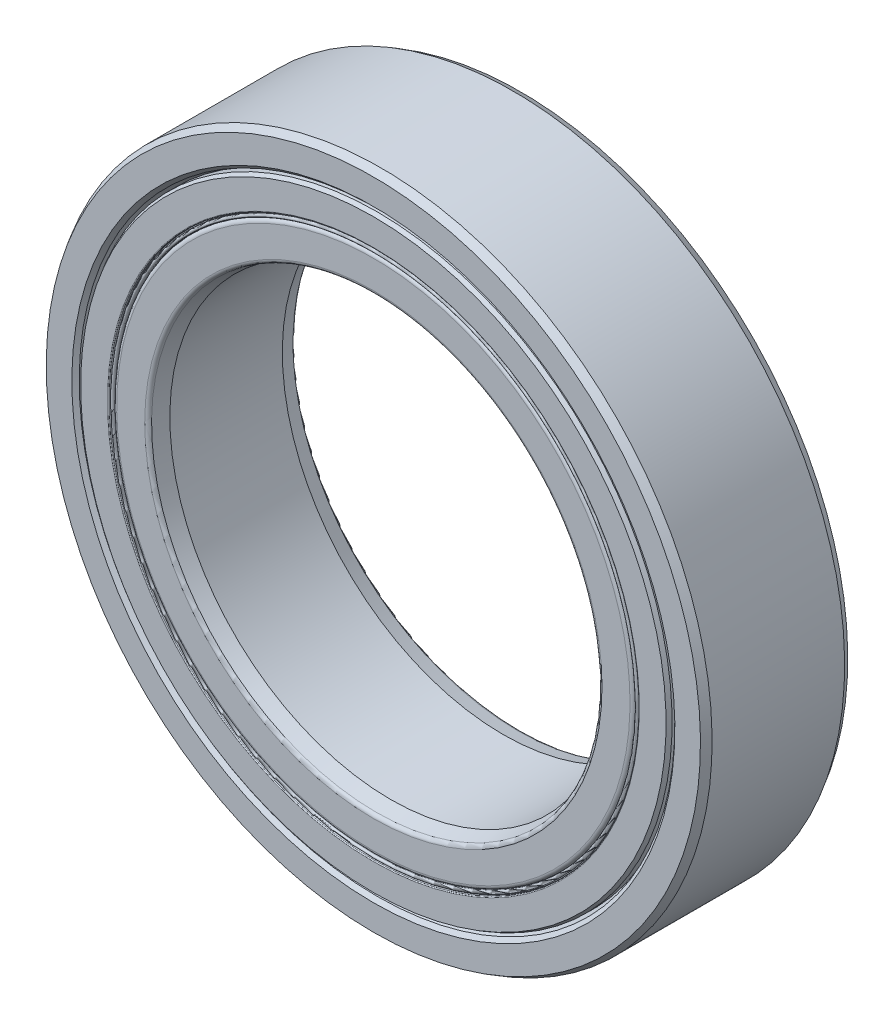
ISO-10303-21;
HEADER;
FILE_DESCRIPTION(('STEP AP214'),'2;1');
FILE_NAME('part.step','',(''),(''),'','','');
FILE_SCHEMA(('AUTOMOTIVE_DESIGN { 1 0 10303 214 1 1 1 1 }'));
ENDSEC;
DATA;
#1=APPLICATION_CONTEXT('core data for automotive mechanical design processes');
#2=APPLICATION_PROTOCOL_DEFINITION('international standard','automotive_design',2000,#1);
#3=PRODUCT_CONTEXT('',#1,'mechanical');
#4=PRODUCT('Part','Part','',(#3));
#5=PRODUCT_RELATED_PRODUCT_CATEGORY('part','',(#4));
#6=PRODUCT_DEFINITION_FORMATION('','',#4);
#7=PRODUCT_DEFINITION_CONTEXT('part definition',#1,'design');
#8=PRODUCT_DEFINITION('design','',#6,#7);
#9=PRODUCT_DEFINITION_SHAPE('','',#8);
#10=(LENGTH_UNIT() NAMED_UNIT(*) SI_UNIT(.MILLI.,.METRE.));
#11=(NAMED_UNIT(*) PLANE_ANGLE_UNIT() SI_UNIT($,.RADIAN.));
#12=(NAMED_UNIT(*) SI_UNIT($,.STERADIAN.) SOLID_ANGLE_UNIT());
#13=UNCERTAINTY_MEASURE_WITH_UNIT(LENGTH_MEASURE(1.E-05),#10,'distance_accuracy_value','');
#14=(GEOMETRIC_REPRESENTATION_CONTEXT(3) GLOBAL_UNCERTAINTY_ASSIGNED_CONTEXT((#13)) GLOBAL_UNIT_ASSIGNED_CONTEXT((#10,
#11,#12)) REPRESENTATION_CONTEXT('',''));
#15=CARTESIAN_POINT('',(0.,0.,0.));
#16=DIRECTION('',(0.,0.,1.));
#17=DIRECTION('',(1.,0.,0.));
#18=AXIS2_PLACEMENT_3D('',#15,#16,#17);
#19=CARTESIAN_POINT('',(0.,7.07999999999999,1.125));
#20=DIRECTION('',(0.,0.,1.));
#21=DIRECTION('',(0.,-1.,0.));
#22=AXIS2_PLACEMENT_3D('',#19,#20,#21);
#23=PLANE('',#22);
#24=CARTESIAN_POINT('',(0.,0.,1.125));
#25=DIRECTION('',(0.,0.,1.));
#26=DIRECTION('',(0.,-1.,0.));
#27=AXIS2_PLACEMENT_3D('',#24,#25,#26);
#28=CIRCLE('',#27,7.19999999999999);
#29=CARTESIAN_POINT('',(0.,-7.19999999999999,1.125));
#30=VERTEX_POINT('',#29);
#31=EDGE_CURVE('E11',#30,#30,#28,.T.);
#32=ORIENTED_EDGE('',*,*,#31,.F.);
#33=EDGE_LOOP('',(#32));
#34=FACE_BOUND('',#33,.T.);
#35=CARTESIAN_POINT('',(0.,0.,1.125));
#36=DIRECTION('',(0.,0.,1.));
#37=DIRECTION('',(0.,-1.,0.));
#38=AXIS2_PLACEMENT_3D('',#35,#36,#37);
#39=CIRCLE('',#38,7.07999999999999);
#40=CARTESIAN_POINT('',(0.,-7.07999999999999,1.125));
#41=VERTEX_POINT('',#40);
#42=EDGE_CURVE('E73',#41,#41,#39,.T.);
#43=ORIENTED_EDGE('',*,*,#42,.T.);
#44=EDGE_LOOP('',(#43));
#45=FACE_BOUND('',#44,.T.);
#46=ADVANCED_FACE('F48',(#34,#45),#23,.F.);
#47=CARTESIAN_POINT('',(0.,0.,2.));
#48=DIRECTION('',(0.,0.,1.));
#49=DIRECTION('',(0.,-1.,0.));
#50=AXIS2_PLACEMENT_3D('',#47,#48,#49);
#51=CYLINDRICAL_SURFACE('',#50,7.19999999999999);
#52=CARTESIAN_POINT('',(0.,0.,1.90262465990578));
#53=DIRECTION('',(0.,0.,1.));
#54=DIRECTION('',(0.,-1.,0.));
#55=AXIS2_PLACEMENT_3D('',#52,#53,#54);
#56=CIRCLE('',#55,7.19999999999999);
#57=CARTESIAN_POINT('',(0.,-7.19999999999999,1.90262465990578));
#58=VERTEX_POINT('',#57);
#59=EDGE_CURVE('E54',#58,#58,#56,.T.);
#60=ORIENTED_EDGE('',*,*,#59,.F.);
#61=EDGE_LOOP('',(#60));
#62=FACE_BOUND('',#61,.T.);
#63=ORIENTED_EDGE('',*,*,#31,.T.);
#64=EDGE_LOOP('',(#63));
#65=FACE_BOUND('',#64,.T.);
#66=ADVANCED_FACE('F104',(#62,#65),#51,.T.);
#67=CARTESIAN_POINT('',(0.,0.,1.90262465990578));
#68=DIRECTION('',(0.,0.,-1.));
#69=DIRECTION('',(0.,1.,0.));
#70=AXIS2_PLACEMENT_3D('',#67,#68,#69);
#71=CONICAL_SURFACE('',#70,7.19999999999999,0.174532925199437);
#72=CARTESIAN_POINT('',(0.,0.,1.93216889249615));
#73=DIRECTION('',(0.,0.,1.));
#74=DIRECTION('',(0.,-1.,0.));
#75=AXIS2_PLACEMENT_3D('',#72,#73,#74);
#76=CIRCLE('',#75,7.19479055466999);
#77=CARTESIAN_POINT('',(0.,-7.19479055466999,1.93216889249615));
#78=VERTEX_POINT('',#77);
#79=EDGE_CURVE('E58',#78,#78,#76,.T.);
#80=ORIENTED_EDGE('',*,*,#79,.F.);
#81=EDGE_LOOP('',(#80));
#82=FACE_BOUND('',#81,.T.);
#83=ORIENTED_EDGE('',*,*,#59,.T.);
#84=EDGE_LOOP('',(#83));
#85=FACE_BOUND('',#84,.T.);
#86=ADVANCED_FACE('F99',(#82,#85),#71,.T.);
#87=CARTESIAN_POINT('',(0.,0.,1.93));
#88=DIRECTION('',(0.,0.,1.));
#89=DIRECTION('',(0.,-1.,0.));
#90=AXIS2_PLACEMENT_3D('',#87,#88,#89);
#91=TOROIDAL_SURFACE('',#90,7.1824901540879,0.0124901540879058);
#92=CARTESIAN_POINT('',(0.,0.,1.93));
#93=DIRECTION('',(0.,0.,1.));
#94=DIRECTION('',(0.,-1.,0.));
#95=AXIS2_PLACEMENT_3D('',#92,#93,#94);
#96=CIRCLE('',#95,7.16999999999999);
#97=CARTESIAN_POINT('',(0.,-7.16999999999999,1.93));
#98=VERTEX_POINT('',#97);
#99=EDGE_CURVE('E62',#98,#98,#96,.T.);
#100=ORIENTED_EDGE('',*,*,#99,.F.);
#101=EDGE_LOOP('',(#100));
#102=FACE_BOUND('',#101,.T.);
#103=ORIENTED_EDGE('',*,*,#79,.T.);
#104=EDGE_LOOP('',(#103));
#105=FACE_BOUND('',#104,.T.);
#106=ADVANCED_FACE('F93',(#102,#105),#91,.T.);
#107=CARTESIAN_POINT('',(0.,0.,2.));
#108=DIRECTION('',(0.,0.,1.));
#109=DIRECTION('',(0.,-1.,0.));
#110=AXIS2_PLACEMENT_3D('',#107,#108,#109);
#111=CYLINDRICAL_SURFACE('',#110,7.16999999999999);
#112=CARTESIAN_POINT('',(0.,0.,1.955));
#113=DIRECTION('',(0.,0.,1.));
#114=DIRECTION('',(0.,-1.,0.));
#115=AXIS2_PLACEMENT_3D('',#112,#113,#114);
#116=CIRCLE('',#115,7.16999999999999);
#117=CARTESIAN_POINT('',(0.,-7.16999999999999,1.955));
#118=VERTEX_POINT('',#117);
#119=EDGE_CURVE('E67',#118,#118,#116,.T.);
#120=ORIENTED_EDGE('',*,*,#119,.F.);
#121=EDGE_LOOP('',(#120));
#122=FACE_BOUND('',#121,.T.);
#123=ORIENTED_EDGE('',*,*,#99,.T.);
#124=EDGE_LOOP('',(#123));
#125=FACE_BOUND('',#124,.T.);
#126=ADVANCED_FACE('F87',(#122,#125),#111,.T.);
#127=CARTESIAN_POINT('',(0.,0.,1.955));
#128=DIRECTION('',(0.,0.,1.));
#129=DIRECTION('',(0.,-1.,0.));
#130=AXIS2_PLACEMENT_3D('',#127,#128,#129);
#131=TOROIDAL_SURFACE('',#130,7.12499999999999,0.0449999999999999);
#132=CARTESIAN_POINT('',(0.,0.,1.955));
#133=DIRECTION('',(0.,0.,1.));
#134=DIRECTION('',(0.,-1.,0.));
#135=AXIS2_PLACEMENT_3D('',#132,#133,#134);
#136=CIRCLE('',#135,7.07999999999999);
#137=CARTESIAN_POINT('',(0.,-7.07999999999999,1.955));
#138=VERTEX_POINT('',#137);
#139=EDGE_CURVE('E70',#138,#138,#136,.T.);
#140=ORIENTED_EDGE('',*,*,#139,.F.);
#141=EDGE_LOOP('',(#140));
#142=FACE_BOUND('',#141,.T.);
#143=ORIENTED_EDGE('',*,*,#119,.T.);
#144=EDGE_LOOP('',(#143));
#145=FACE_BOUND('',#144,.T.);
#146=ADVANCED_FACE('F81',(#142,#145),#131,.T.);
#147=CARTESIAN_POINT('',(0.,0.,2.));
#148=DIRECTION('',(0.,0.,1.));
#149=DIRECTION('',(0.,-1.,0.));
#150=AXIS2_PLACEMENT_3D('',#147,#148,#149);
#151=CYLINDRICAL_SURFACE('',#150,7.07999999999999);
#152=ORIENTED_EDGE('',*,*,#42,.F.);
#153=EDGE_LOOP('',(#152));
#154=FACE_BOUND('',#153,.T.);
#155=ORIENTED_EDGE('',*,*,#139,.T.);
#156=EDGE_LOOP('',(#155));
#157=FACE_BOUND('',#156,.T.);
#158=ADVANCED_FACE('F78',(#154,#157),#151,.F.);
#159=CLOSED_SHELL('',(#46,#66,#86,#106,#126,#146,#158));
#160=MANIFOLD_SOLID_BREP('B2',#159);
#161=CARTESIAN_POINT('',(0.,0.,-2.00000000000001));
#162=DIRECTION('',(0.,0.,1.));
#163=DIRECTION('',(0.,-1.,0.));
#164=AXIS2_PLACEMENT_3D('',#161,#162,#163);
#165=CONICAL_SURFACE('',#164,7.95,0.523598775598297);
#166=CARTESIAN_POINT('',(0.,0.,-1.89607695154587));
#167=DIRECTION('',(0.,0.,1.));
#168=DIRECTION('',(0.,-1.,0.));
#169=AXIS2_PLACEMENT_3D('',#166,#167,#168);
#170=CIRCLE('',#169,8.01);
#171=CARTESIAN_POINT('',(0.,-8.01,-1.89607695154587));
#172=VERTEX_POINT('',#171);
#173=EDGE_CURVE('E185',#172,#172,#170,.T.);
#174=ORIENTED_EDGE('',*,*,#173,.F.);
#175=EDGE_LOOP('',(#174));
#176=FACE_BOUND('',#175,.T.);
#177=CARTESIAN_POINT('',(0.,0.,-2.00000000000001));
#178=DIRECTION('',(0.,0.,1.));
#179=DIRECTION('',(0.,-1.,0.));
#180=AXIS2_PLACEMENT_3D('',#177,#178,#179);
#181=CIRCLE('',#180,7.95);
#182=CARTESIAN_POINT('',(0.,-7.95,-2.00000000000001));
#183=VERTEX_POINT('',#182);
#184=EDGE_CURVE('E47',#183,#183,#181,.T.);
#185=ORIENTED_EDGE('',*,*,#184,.T.);
#186=EDGE_LOOP('',(#185));
#187=FACE_BOUND('',#186,.T.);
#188=ADVANCED_FACE('F163',(#176,#187),#165,.T.);
#189=CARTESIAN_POINT('',(0.,7.95,-2.));
#190=DIRECTION('',(0.,0.,1.));
#191=DIRECTION('',(0.,-1.,0.));
#192=AXIS2_PLACEMENT_3D('',#189,#190,#191);
#193=PLANE('',#192);
#194=ORIENTED_EDGE('',*,*,#184,.F.);
#195=EDGE_LOOP('',(#194));
#196=FACE_BOUND('',#195,.T.);
#197=CARTESIAN_POINT('',(0.,0.,-2.00000000000001));
#198=DIRECTION('',(0.,0.,1.));
#199=DIRECTION('',(0.,-1.,0.));
#200=AXIS2_PLACEMENT_3D('',#197,#198,#199);
#201=CIRCLE('',#200,7.22399999999999);
#202=CARTESIAN_POINT('',(0.,-7.22399999999999,-2.00000000000001));
#203=VERTEX_POINT('',#202);
#204=EDGE_CURVE('E169',#203,#203,#201,.T.);
#205=ORIENTED_EDGE('',*,*,#204,.T.);
#206=EDGE_LOOP('',(#205));
#207=FACE_BOUND('',#206,.T.);
#208=ADVANCED_FACE('F192',(#196,#207),#193,.F.);
#209=CARTESIAN_POINT('',(0.,0.,-1.97600000000001));
#210=DIRECTION('',(0.,0.,1.));
#211=DIRECTION('',(0.,-1.,0.));
#212=AXIS2_PLACEMENT_3D('',#209,#210,#211);
#213=TOROIDAL_SURFACE('',#212,7.22399999999999,0.0239999999999997);
#214=ORIENTED_EDGE('',*,*,#204,.F.);
#215=EDGE_LOOP('',(#214));
#216=FACE_BOUND('',#215,.T.);
#217=CARTESIAN_POINT('',(0.,0.,-1.97600000000001));
#218=DIRECTION('',(0.,0.,1.));
#219=DIRECTION('',(0.,-1.,0.));
#220=AXIS2_PLACEMENT_3D('',#217,#218,#219);
#221=CIRCLE('',#220,7.19999999999999);
#222=CARTESIAN_POINT('',(0.,-7.19999999999999,-1.97600000000001));
#223=VERTEX_POINT('',#222);
#224=EDGE_CURVE('E173',#223,#223,#221,.T.);
#225=ORIENTED_EDGE('',*,*,#224,.T.);
#226=EDGE_LOOP('',(#225));
#227=FACE_BOUND('',#226,.T.);
#228=ADVANCED_FACE('F196',(#216,#227),#213,.T.);
#229=CARTESIAN_POINT('',(0.,0.,2.));
#230=DIRECTION('',(0.,0.,1.));
#231=DIRECTION('',(0.,-1.,0.));
#232=AXIS2_PLACEMENT_3D('',#229,#230,#231);
#233=CYLINDRICAL_SURFACE('',#232,7.19999999999999);
#234=ORIENTED_EDGE('',*,*,#224,.F.);
#235=EDGE_LOOP('',(#234));
#236=FACE_BOUND('',#235,.T.);
#237=CARTESIAN_POINT('',(0.,0.,-1.125));
#238=DIRECTION('',(0.,0.,1.));
#239=DIRECTION('',(0.,-1.,0.));
#240=AXIS2_PLACEMENT_3D('',#237,#238,#239);
#241=CIRCLE('',#240,7.19999999999999);
#242=CARTESIAN_POINT('',(0.,-7.19999999999999,-1.125));
#243=VERTEX_POINT('',#242);
#244=EDGE_CURVE('E177',#243,#243,#241,.T.);
#245=ORIENTED_EDGE('',*,*,#244,.T.);
#246=EDGE_LOOP('',(#245));
#247=FACE_BOUND('',#246,.T.);
#248=ADVANCED_FACE('F201',(#236,#247),#233,.F.);
#249=CARTESIAN_POINT('',(0.,8.01,-1.125));
#250=DIRECTION('',(0.,0.,-1.));
#251=DIRECTION('',(0.,1.,0.));
#252=AXIS2_PLACEMENT_3D('',#249,#250,#251);
#253=PLANE('',#252);
#254=ORIENTED_EDGE('',*,*,#244,.F.);
#255=EDGE_LOOP('',(#254));
#256=FACE_BOUND('',#255,.T.);
#257=CARTESIAN_POINT('',(0.,0.,-1.125));
#258=DIRECTION('',(0.,0.,1.));
#259=DIRECTION('',(0.,-1.,0.));
#260=AXIS2_PLACEMENT_3D('',#257,#258,#259);
#261=CIRCLE('',#260,8.01);
#262=CARTESIAN_POINT('',(0.,-8.01,-1.125));
#263=VERTEX_POINT('',#262);
#264=EDGE_CURVE('E182',#263,#263,#261,.T.);
#265=ORIENTED_EDGE('',*,*,#264,.T.);
#266=EDGE_LOOP('',(#265));
#267=FACE_BOUND('',#266,.T.);
#268=ADVANCED_FACE('F207',(#256,#267),#253,.F.);
#269=CARTESIAN_POINT('',(0.,0.,2.));
#270=DIRECTION('',(0.,0.,1.));
#271=DIRECTION('',(0.,-1.,0.));
#272=AXIS2_PLACEMENT_3D('',#269,#270,#271);
#273=CYLINDRICAL_SURFACE('',#272,8.01);
#274=ORIENTED_EDGE('',*,*,#264,.F.);
#275=EDGE_LOOP('',(#274));
#276=FACE_BOUND('',#275,.T.);
#277=ORIENTED_EDGE('',*,*,#173,.T.);
#278=EDGE_LOOP('',(#277));
#279=FACE_BOUND('',#278,.T.);
#280=ADVANCED_FACE('F189',(#276,#279),#273,.T.);
#281=CLOSED_SHELL('',(#188,#208,#228,#248,#268,#280));
#282=MANIFOLD_SOLID_BREP('B6',#281);
#283=CARTESIAN_POINT('',(0.,8.01,1.125));
#284=DIRECTION('',(0.,0.,1.));
#285=DIRECTION('',(0.,-1.,0.));
#286=AXIS2_PLACEMENT_3D('',#283,#284,#285);
#287=PLANE('',#286);
#288=CARTESIAN_POINT('',(0.,0.,1.125));
#289=DIRECTION('',(0.,0.,1.));
#290=DIRECTION('',(0.,-1.,0.));
#291=AXIS2_PLACEMENT_3D('',#288,#289,#290);
#292=CIRCLE('',#291,8.01);
#293=CARTESIAN_POINT('',(0.,-8.01,1.125));
#294=VERTEX_POINT('',#293);
#295=EDGE_CURVE('E162',#294,#294,#292,.T.);
#296=ORIENTED_EDGE('',*,*,#295,.F.);
#297=EDGE_LOOP('',(#296));
#298=FACE_BOUND('',#297,.T.);
#299=CARTESIAN_POINT('',(0.,0.,1.125));
#300=DIRECTION('',(0.,0.,1.));
#301=DIRECTION('',(0.,-1.,0.));
#302=AXIS2_PLACEMENT_3D('',#299,#300,#301);
#303=CIRCLE('',#302,7.19999999999999);
#304=CARTESIAN_POINT('',(0.,-7.19999999999999,1.125));
#305=VERTEX_POINT('',#304);
#306=EDGE_CURVE('E283',#305,#305,#303,.T.);
#307=ORIENTED_EDGE('',*,*,#306,.T.);
#308=EDGE_LOOP('',(#307));
#309=FACE_BOUND('',#308,.T.);
#310=ADVANCED_FACE('F261',(#298,#309),#287,.F.);
#311=CARTESIAN_POINT('',(0.,0.,2.));
#312=DIRECTION('',(0.,0.,1.));
#313=DIRECTION('',(0.,-1.,0.));
#314=AXIS2_PLACEMENT_3D('',#311,#312,#313);
#315=CYLINDRICAL_SURFACE('',#314,8.01);
#316=CARTESIAN_POINT('',(0.,0.,1.89607695154587));
#317=DIRECTION('',(0.,0.,1.));
#318=DIRECTION('',(0.,-1.,0.));
#319=AXIS2_PLACEMENT_3D('',#316,#317,#318);
#320=CIRCLE('',#319,8.01);
#321=CARTESIAN_POINT('',(0.,-8.01,1.89607695154587));
#322=VERTEX_POINT('',#321);
#323=EDGE_CURVE('E267',#322,#322,#320,.T.);
#324=ORIENTED_EDGE('',*,*,#323,.F.);
#325=EDGE_LOOP('',(#324));
#326=FACE_BOUND('',#325,.T.);
#327=ORIENTED_EDGE('',*,*,#295,.T.);
#328=EDGE_LOOP('',(#327));
#329=FACE_BOUND('',#328,.T.);
#330=ADVANCED_FACE('F308',(#326,#329),#315,.T.);
#331=CARTESIAN_POINT('',(0.,0.,1.89607695154587));
#332=DIRECTION('',(0.,0.,-1.));
#333=DIRECTION('',(0.,1.,0.));
#334=AXIS2_PLACEMENT_3D('',#331,#332,#333);
#335=CONICAL_SURFACE('',#334,8.01,0.523598775598298);
#336=CARTESIAN_POINT('',(0.,0.,2.));
#337=DIRECTION('',(0.,0.,1.));
#338=DIRECTION('',(0.,-1.,0.));
#339=AXIS2_PLACEMENT_3D('',#336,#337,#338);
#340=CIRCLE('',#339,7.95);
#341=CARTESIAN_POINT('',(0.,-7.95,2.));
#342=VERTEX_POINT('',#341);
#343=EDGE_CURVE('E271',#342,#342,#340,.T.);
#344=ORIENTED_EDGE('',*,*,#343,.F.);
#345=EDGE_LOOP('',(#344));
#346=FACE_BOUND('',#345,.T.);
#347=ORIENTED_EDGE('',*,*,#323,.T.);
#348=EDGE_LOOP('',(#347));
#349=FACE_BOUND('',#348,.T.);
#350=ADVANCED_FACE('F303',(#346,#349),#335,.T.);
#351=CARTESIAN_POINT('',(0.,7.95,2.));
#352=DIRECTION('',(0.,0.,-1.));
#353=DIRECTION('',(0.,1.,0.));
#354=AXIS2_PLACEMENT_3D('',#351,#352,#353);
#355=PLANE('',#354);
#356=CARTESIAN_POINT('',(0.,0.,2.));
#357=DIRECTION('',(0.,0.,1.));
#358=DIRECTION('',(0.,-1.,0.));
#359=AXIS2_PLACEMENT_3D('',#356,#357,#358);
#360=CIRCLE('',#359,7.22399999999999);
#361=CARTESIAN_POINT('',(0.,-7.22399999999999,2.));
#362=VERTEX_POINT('',#361);
#363=EDGE_CURVE('E275',#362,#362,#360,.T.);
#364=ORIENTED_EDGE('',*,*,#363,.F.);
#365=EDGE_LOOP('',(#364));
#366=FACE_BOUND('',#365,.T.);
#367=ORIENTED_EDGE('',*,*,#343,.T.);
#368=EDGE_LOOP('',(#367));
#369=FACE_BOUND('',#368,.T.);
#370=ADVANCED_FACE('F297',(#366,#369),#355,.F.);
#371=CARTESIAN_POINT('',(0.,0.,1.976));
#372=DIRECTION('',(0.,0.,1.));
#373=DIRECTION('',(0.,-1.,0.));
#374=AXIS2_PLACEMENT_3D('',#371,#372,#373);
#375=TOROIDAL_SURFACE('',#374,7.22399999999999,0.0239999999999997);
#376=CARTESIAN_POINT('',(0.,0.,1.976));
#377=DIRECTION('',(0.,0.,1.));
#378=DIRECTION('',(0.,-1.,0.));
#379=AXIS2_PLACEMENT_3D('',#376,#377,#378);
#380=CIRCLE('',#379,7.19999999999999);
#381=CARTESIAN_POINT('',(0.,-7.19999999999999,1.976));
#382=VERTEX_POINT('',#381);
#383=EDGE_CURVE('E280',#382,#382,#380,.T.);
#384=ORIENTED_EDGE('',*,*,#383,.F.);
#385=EDGE_LOOP('',(#384));
#386=FACE_BOUND('',#385,.T.);
#387=ORIENTED_EDGE('',*,*,#363,.T.);
#388=EDGE_LOOP('',(#387));
#389=FACE_BOUND('',#388,.T.);
#390=ADVANCED_FACE('F291',(#386,#389),#375,.T.);
#391=CARTESIAN_POINT('',(0.,0.,2.));
#392=DIRECTION('',(0.,0.,1.));
#393=DIRECTION('',(0.,-1.,0.));
#394=AXIS2_PLACEMENT_3D('',#391,#392,#393);
#395=CYLINDRICAL_SURFACE('',#394,7.19999999999999);
#396=ORIENTED_EDGE('',*,*,#306,.F.);
#397=EDGE_LOOP('',(#396));
#398=FACE_BOUND('',#397,.T.);
#399=ORIENTED_EDGE('',*,*,#383,.T.);
#400=EDGE_LOOP('',(#399));
#401=FACE_BOUND('',#400,.T.);
#402=ADVANCED_FACE('F288',(#398,#401),#395,.F.);
#403=CLOSED_SHELL('',(#310,#330,#350,#370,#390,#402));
#404=MANIFOLD_SOLID_BREP('B42',#403);
#405=CARTESIAN_POINT('',(-3.27365281164189,6.79781010832379,0.));
#406=DIRECTION('',(0.,0.,1.));
#407=DIRECTION('',(-0.433883739117546,0.900968867902425,0.));
#408=AXIS2_PLACEMENT_3D('',#405,#406,#407);
#409=SPHERICAL_SURFACE('',#408,1.125);
#410=CARTESIAN_POINT('',(-3.27365281164189,6.79781010832379,1.125));
#411=VERTEX_POINT('',#410);
#412=VERTEX_LOOP('',#411);
#413=FACE_BOUND('',#412,.T.);
#414=ADVANCED_FACE('F377',(#413),#409,.T.);
#415=CLOSED_SHELL('',(#414));
#416=MANIFOLD_SOLID_BREP('B157',#415);
#417=CARTESIAN_POINT('',(-5.89891853522123,4.70423055502422,0.));
#418=DIRECTION('',(0.,0.,1.));
#419=DIRECTION('',(-0.781831482468022,0.623489801858743,0.));
#420=AXIS2_PLACEMENT_3D('',#417,#418,#419);
#421=SPHERICAL_SURFACE('',#420,1.125);
#422=CARTESIAN_POINT('',(-5.89891853522123,4.70423055502422,1.125));
#423=VERTEX_POINT('',#422);
#424=VERTEX_LOOP('',#423);
#425=FACE_BOUND('',#424,.T.);
#426=ADVANCED_FACE('F396',(#425),#421,.T.);
#427=CLOSED_SHELL('',(#426));
#428=MANIFOLD_SOLID_BREP('B257',#427);
#429=CARTESIAN_POINT('',(-7.35583109741184,1.67892044670047,0.));
#430=DIRECTION('',(0.,0.,1.));
#431=DIRECTION('',(-0.974927912181821,0.222520933956325,0.));
#432=AXIS2_PLACEMENT_3D('',#429,#430,#431);
#433=SPHERICAL_SURFACE('',#432,1.125);
#434=CARTESIAN_POINT('',(-7.35583109741184,1.67892044670047,1.125));
#435=VERTEX_POINT('',#434);
#436=VERTEX_LOOP('',#435);
#437=FACE_BOUND('',#436,.T.);
#438=ADVANCED_FACE('F415',(#437),#433,.T.);
#439=CLOSED_SHELL('',(#438));
#440=MANIFOLD_SOLID_BREP('B373',#439);
#441=CARTESIAN_POINT('',(-7.35583109741187,-1.67892044670032,0.));
#442=DIRECTION('',(0.,0.,1.));
#443=DIRECTION('',(-0.974927912181826,-0.222520933956305,0.));
#444=AXIS2_PLACEMENT_3D('',#441,#442,#443);
#445=SPHERICAL_SURFACE('',#444,1.125);
#446=CARTESIAN_POINT('',(-7.35583109741187,-1.67892044670032,1.125));
#447=VERTEX_POINT('',#446);
#448=VERTEX_LOOP('',#447);
#449=FACE_BOUND('',#448,.T.);
#450=ADVANCED_FACE('F434',(#449),#445,.T.);
#451=CLOSED_SHELL('',(#450));
#452=MANIFOLD_SOLID_BREP('B392',#451);
#453=CARTESIAN_POINT('',(-5.89891853522133,-4.70423055502409,0.));
#454=DIRECTION('',(0.,0.,1.));
#455=DIRECTION('',(-0.781831482468035,-0.623489801858727,0.));
#456=AXIS2_PLACEMENT_3D('',#453,#454,#455);
#457=SPHERICAL_SURFACE('',#456,1.125);
#458=CARTESIAN_POINT('',(-5.89891853522133,-4.70423055502409,1.125));
#459=VERTEX_POINT('',#458);
#460=VERTEX_LOOP('',#459);
#461=FACE_BOUND('',#460,.T.);
#462=ADVANCED_FACE('F453',(#461),#457,.T.);
#463=CLOSED_SHELL('',(#462));
#464=MANIFOLD_SOLID_BREP('B411',#463);
#465=CARTESIAN_POINT('',(-3.27365281164203,-6.79781010832373,0.));
#466=DIRECTION('',(0.,0.,1.));
#467=DIRECTION('',(-0.433883739117565,-0.900968867902416,0.));
#468=AXIS2_PLACEMENT_3D('',#465,#466,#467);
#469=SPHERICAL_SURFACE('',#468,1.125);
#470=CARTESIAN_POINT('',(-3.27365281164203,-6.79781010832373,1.125));
#471=VERTEX_POINT('',#470);
#472=VERTEX_LOOP('',#471);
#473=FACE_BOUND('',#472,.T.);
#474=ADVANCED_FACE('F472',(#473),#469,.T.);
#475=CLOSED_SHELL('',(#474));
#476=MANIFOLD_SOLID_BREP('B430',#475);
#477=CARTESIAN_POINT('',(0.,-7.545,0.));
#478=DIRECTION('',(0.,0.,1.));
#479=DIRECTION('',(0.,-1.,0.));
#480=AXIS2_PLACEMENT_3D('',#477,#478,#479);
#481=SPHERICAL_SURFACE('',#480,1.125);
#482=CARTESIAN_POINT('',(0.,-7.545,1.125));
#483=VERTEX_POINT('',#482);
#484=VERTEX_LOOP('',#483);
#485=FACE_BOUND('',#484,.T.);
#486=ADVANCED_FACE('F491',(#485),#481,.T.);
#487=CLOSED_SHELL('',(#486));
#488=MANIFOLD_SOLID_BREP('B449',#487);
#489=CARTESIAN_POINT('',(3.27365281164193,-6.79781010832377,0.));
#490=DIRECTION('',(0.,0.,1.));
#491=DIRECTION('',(0.433883739117553,-0.900968867902422,0.));
#492=AXIS2_PLACEMENT_3D('',#489,#490,#491);
#493=SPHERICAL_SURFACE('',#492,1.125);
#494=CARTESIAN_POINT('',(3.27365281164193,-6.79781010832377,1.125));
#495=VERTEX_POINT('',#494);
#496=VERTEX_LOOP('',#495);
#497=FACE_BOUND('',#496,.T.);
#498=ADVANCED_FACE('F510',(#497),#493,.T.);
#499=CLOSED_SHELL('',(#498));
#500=MANIFOLD_SOLID_BREP('B468',#499);
#501=CARTESIAN_POINT('',(5.89891853522126,-4.70423055502417,0.));
#502=DIRECTION('',(0.,0.,1.));
#503=DIRECTION('',(0.781831482468027,-0.623489801858737,0.));
#504=AXIS2_PLACEMENT_3D('',#501,#502,#503);
#505=SPHERICAL_SURFACE('',#504,1.125);
#506=CARTESIAN_POINT('',(5.89891853522126,-4.70423055502417,1.125));
#507=VERTEX_POINT('',#506);
#508=VERTEX_LOOP('',#507);
#509=FACE_BOUND('',#508,.T.);
#510=ADVANCED_FACE('F529',(#509),#505,.T.);
#511=CLOSED_SHELL('',(#510));
#512=MANIFOLD_SOLID_BREP('B487',#511);
#513=CARTESIAN_POINT('',(7.35583109741185,-1.67892044670042,0.));
#514=DIRECTION('',(0.,0.,1.));
#515=DIRECTION('',(0.974927912181823,-0.222520933956318,0.));
#516=AXIS2_PLACEMENT_3D('',#513,#514,#515);
#517=SPHERICAL_SURFACE('',#516,1.125);
#518=CARTESIAN_POINT('',(7.35583109741185,-1.67892044670042,1.125));
#519=VERTEX_POINT('',#518);
#520=VERTEX_LOOP('',#519);
#521=FACE_BOUND('',#520,.T.);
#522=ADVANCED_FACE('F548',(#521),#517,.T.);
#523=CLOSED_SHELL('',(#522));
#524=MANIFOLD_SOLID_BREP('B506',#523);
#525=CARTESIAN_POINT('',(7.35583109741186,1.67892044670037,0.));
#526=DIRECTION('',(0.,0.,1.));
#527=DIRECTION('',(0.974927912181824,0.222520933956311,0.));
#528=AXIS2_PLACEMENT_3D('',#525,#526,#527);
#529=SPHERICAL_SURFACE('',#528,1.125);
#530=CARTESIAN_POINT('',(7.35583109741186,1.67892044670037,1.125));
#531=VERTEX_POINT('',#530);
#532=VERTEX_LOOP('',#531);
#533=FACE_BOUND('',#532,.T.);
#534=ADVANCED_FACE('F567',(#533),#529,.T.);
#535=CLOSED_SHELL('',(#534));
#536=MANIFOLD_SOLID_BREP('B525',#535);
#537=CARTESIAN_POINT('',(5.89891853522129,4.70423055502413,0.));
#538=DIRECTION('',(0.,0.,1.));
#539=DIRECTION('',(0.781831482468031,0.623489801858732,0.));
#540=AXIS2_PLACEMENT_3D('',#537,#538,#539);
#541=SPHERICAL_SURFACE('',#540,1.125);
#542=CARTESIAN_POINT('',(5.89891853522129,4.70423055502413,1.125));
#543=VERTEX_POINT('',#542);
#544=VERTEX_LOOP('',#543);
#545=FACE_BOUND('',#544,.T.);
#546=ADVANCED_FACE('F586',(#545),#541,.T.);
#547=CLOSED_SHELL('',(#546));
#548=MANIFOLD_SOLID_BREP('B544',#547);
#549=CARTESIAN_POINT('',(3.27365281164198,6.79781010832375,0.));
#550=DIRECTION('',(0.,0.,1.));
#551=DIRECTION('',(0.433883739117559,0.900968867902419,0.));
#552=AXIS2_PLACEMENT_3D('',#549,#550,#551);
#553=SPHERICAL_SURFACE('',#552,1.125);
#554=CARTESIAN_POINT('',(3.27365281164198,6.79781010832375,1.125));
#555=VERTEX_POINT('',#554);
#556=VERTEX_LOOP('',#555);
#557=FACE_BOUND('',#556,.T.);
#558=ADVANCED_FACE('F605',(#557),#553,.T.);
#559=CLOSED_SHELL('',(#558));
#560=MANIFOLD_SOLID_BREP('B563',#559);
#561=CARTESIAN_POINT('',(0.,7.545,0.));
#562=DIRECTION('',(0.,0.,1.));
#563=DIRECTION('',(0.,1.,0.));
#564=AXIS2_PLACEMENT_3D('',#561,#562,#563);
#565=SPHERICAL_SURFACE('',#564,1.125);
#566=CARTESIAN_POINT('',(0.,7.545,1.125));
#567=VERTEX_POINT('',#566);
#568=VERTEX_LOOP('',#567);
#569=FACE_BOUND('',#568,.T.);
#570=ADVANCED_FACE('F626',(#569),#565,.T.);
#571=CLOSED_SHELL('',(#570));
#572=MANIFOLD_SOLID_BREP('B582',#571);
#573=CARTESIAN_POINT('',(0.,0.,-1.89129600105695));
#574=DIRECTION('',(0.,0.,1.));
#575=DIRECTION('',(0.,-1.,0.));
#576=AXIS2_PLACEMENT_3D('',#573,#574,#575);
#577=TOROIDAL_SURFACE('',#576,6.21,0.108703998943058);
#578=CARTESIAN_POINT('',(0.,0.,-2.));
#579=DIRECTION('',(0.,0.,1.));
#580=DIRECTION('',(0.,-1.,0.));
#581=AXIS2_PLACEMENT_3D('',#578,#579,#580);
#582=CIRCLE('',#581,6.21);
#583=CARTESIAN_POINT('',(0.,-6.21,-2.));
#584=VERTEX_POINT('',#583);
#585=EDGE_CURVE('E625',#584,#584,#582,.T.);
#586=ORIENTED_EDGE('',*,*,#585,.F.);
#587=EDGE_LOOP('',(#586));
#588=FACE_BOUND('',#587,.T.);
#589=CARTESIAN_POINT('',(0.,0.,-1.91943066626221));
#590=DIRECTION('',(0.,0.,1.));
#591=DIRECTION('',(0.,-1.,0.));
#592=AXIS2_PLACEMENT_3D('',#589,#590,#591);
#593=CIRCLE('',#592,6.105);
#594=CARTESIAN_POINT('',(0.,-6.105,-1.91943066626221));
#595=VERTEX_POINT('',#594);
#596=EDGE_CURVE('E686',#595,#595,#593,.T.);
#597=ORIENTED_EDGE('',*,*,#596,.T.);
#598=EDGE_LOOP('',(#597));
#599=FACE_BOUND('',#598,.T.);
#600=ADVANCED_FACE('F646',(#588,#599),#577,.T.);
#601=CARTESIAN_POINT('',(0.,6.21,-2.));
#602=DIRECTION('',(0.,0.,1.));
#603=DIRECTION('',(0.,-1.,0.));
#604=AXIS2_PLACEMENT_3D('',#601,#602,#603);
#605=PLANE('',#604);
#606=CARTESIAN_POINT('',(0.,0.,-2.));
#607=DIRECTION('',(0.,0.,1.));
#608=DIRECTION('',(0.,-1.,0.));
#609=AXIS2_PLACEMENT_3D('',#606,#607,#608);
#610=CIRCLE('',#609,6.97129600105694);
#611=CARTESIAN_POINT('',(0.,-6.97129600105694,-2.));
#612=VERTEX_POINT('',#611);
#613=EDGE_CURVE('E652',#612,#612,#610,.T.);
#614=ORIENTED_EDGE('',*,*,#613,.F.);
#615=EDGE_LOOP('',(#614));
#616=FACE_BOUND('',#615,.T.);
#617=ORIENTED_EDGE('',*,*,#585,.T.);
#618=EDGE_LOOP('',(#617));
#619=FACE_BOUND('',#618,.T.);
#620=ADVANCED_FACE('F747',(#616,#619),#605,.F.);
#621=CARTESIAN_POINT('',(0.,0.,-1.89129600105695));
#622=DIRECTION('',(0.,0.,1.));
#623=DIRECTION('',(0.,-1.,0.));
#624=AXIS2_PLACEMENT_3D('',#621,#622,#623);
#625=TOROIDAL_SURFACE('',#624,6.97129600105694,0.108703998943056);
#626=CARTESIAN_POINT('',(0.,0.,-1.89129600105695));
#627=DIRECTION('',(0.,0.,1.));
#628=DIRECTION('',(0.,-1.,0.));
#629=AXIS2_PLACEMENT_3D('',#626,#627,#628);
#630=CIRCLE('',#629,7.07999999999999);
#631=CARTESIAN_POINT('',(0.,-7.07999999999999,-1.89129600105695));
#632=VERTEX_POINT('',#631);
#633=EDGE_CURVE('E656',#632,#632,#630,.T.);
#634=ORIENTED_EDGE('',*,*,#633,.F.);
#635=EDGE_LOOP('',(#634));
#636=FACE_BOUND('',#635,.T.);
#637=ORIENTED_EDGE('',*,*,#613,.T.);
#638=EDGE_LOOP('',(#637));
#639=FACE_BOUND('',#638,.T.);
#640=ADVANCED_FACE('F742',(#636,#639),#625,.T.);
#641=CARTESIAN_POINT('',(0.,0.,2.));
#642=DIRECTION('',(0.,0.,1.));
#643=DIRECTION('',(0.,-1.,0.));
#644=AXIS2_PLACEMENT_3D('',#641,#642,#643);
#645=CYLINDRICAL_SURFACE('',#644,7.07999999999999);
#646=CARTESIAN_POINT('',(0.,0.,-1.02440226473783));
#647=DIRECTION('',(0.,0.,1.));
#648=DIRECTION('',(0.,-1.,0.));
#649=AXIS2_PLACEMENT_3D('',#646,#647,#648);
#650=CIRCLE('',#649,7.07999999999999);
#651=CARTESIAN_POINT('',(0.,-7.07999999999999,-1.02440226473783));
#652=VERTEX_POINT('',#651);
#653=EDGE_CURVE('E660',#652,#652,#650,.T.);
#654=ORIENTED_EDGE('',*,*,#653,.F.);
#655=EDGE_LOOP('',(#654));
#656=FACE_BOUND('',#655,.T.);
#657=ORIENTED_EDGE('',*,*,#633,.T.);
#658=EDGE_LOOP('',(#657));
#659=FACE_BOUND('',#658,.T.);
#660=ADVANCED_FACE('F736',(#656,#659),#645,.T.);
#661=CARTESIAN_POINT('',(0.,0.,0.));
#662=DIRECTION('',(0.,0.,1.));
#663=DIRECTION('',(0.,-1.,0.));
#664=AXIS2_PLACEMENT_3D('',#661,#662,#663);
#665=TOROIDAL_SURFACE('',#664,7.545,1.125);
#666=CARTESIAN_POINT('',(0.,0.,1.02440226473783));
#667=DIRECTION('',(0.,0.,1.));
#668=DIRECTION('',(0.,-1.,0.));
#669=AXIS2_PLACEMENT_3D('',#666,#667,#668);
#670=CIRCLE('',#669,7.08);
#671=CARTESIAN_POINT('',(0.,-7.08,1.02440226473783));
#672=VERTEX_POINT('',#671);
#673=EDGE_CURVE('E665',#672,#672,#670,.T.);
#674=ORIENTED_EDGE('',*,*,#673,.F.);
#675=EDGE_LOOP('',(#674));
#676=FACE_BOUND('',#675,.T.);
#677=ORIENTED_EDGE('',*,*,#653,.T.);
#678=EDGE_LOOP('',(#677));
#679=FACE_BOUND('',#678,.T.);
#680=ADVANCED_FACE('F730',(#676,#679),#665,.F.);
#681=CARTESIAN_POINT('',(0.,0.,2.));
#682=DIRECTION('',(0.,0.,1.));
#683=DIRECTION('',(0.,-1.,0.));
#684=AXIS2_PLACEMENT_3D('',#681,#682,#683);
#685=CYLINDRICAL_SURFACE('',#684,7.08);
#686=CARTESIAN_POINT('',(0.,0.,1.89129600105694));
#687=DIRECTION('',(0.,0.,1.));
#688=DIRECTION('',(0.,-1.,0.));
#689=AXIS2_PLACEMENT_3D('',#686,#687,#688);
#690=CIRCLE('',#689,7.08);
#691=CARTESIAN_POINT('',(0.,-7.08,1.89129600105694));
#692=VERTEX_POINT('',#691);
#693=EDGE_CURVE('E668',#692,#692,#690,.T.);
#694=ORIENTED_EDGE('',*,*,#693,.F.);
#695=EDGE_LOOP('',(#694));
#696=FACE_BOUND('',#695,.T.);
#697=ORIENTED_EDGE('',*,*,#673,.T.);
#698=EDGE_LOOP('',(#697));
#699=FACE_BOUND('',#698,.T.);
#700=ADVANCED_FACE('F724',(#696,#699),#685,.T.);
#701=CARTESIAN_POINT('',(0.,0.,1.89129600105694));
#702=DIRECTION('',(0.,0.,1.));
#703=DIRECTION('',(0.,-1.,0.));
#704=AXIS2_PLACEMENT_3D('',#701,#702,#703);
#705=TOROIDAL_SURFACE('',#704,6.97129600105694,0.108703998943056);
#706=CARTESIAN_POINT('',(0.,0.,2.));
#707=DIRECTION('',(0.,0.,1.));
#708=DIRECTION('',(0.,-1.,0.));
#709=AXIS2_PLACEMENT_3D('',#706,#707,#708);
#710=CIRCLE('',#709,6.97129600105694);
#711=CARTESIAN_POINT('',(0.,-6.97129600105694,2.));
#712=VERTEX_POINT('',#711);
#713=EDGE_CURVE('E671',#712,#712,#710,.T.);
#714=ORIENTED_EDGE('',*,*,#713,.F.);
#715=EDGE_LOOP('',(#714));
#716=FACE_BOUND('',#715,.T.);
#717=ORIENTED_EDGE('',*,*,#693,.T.);
#718=EDGE_LOOP('',(#717));
#719=FACE_BOUND('',#718,.T.);
#720=ADVANCED_FACE('F718',(#716,#719),#705,.T.);
#721=CARTESIAN_POINT('',(0.,6.21,2.));
#722=DIRECTION('',(0.,0.,-1.));
#723=DIRECTION('',(0.,1.,0.));
#724=AXIS2_PLACEMENT_3D('',#721,#722,#723);
#725=PLANE('',#724);
#726=CARTESIAN_POINT('',(0.,0.,2.));
#727=DIRECTION('',(0.,0.,1.));
#728=DIRECTION('',(0.,-1.,0.));
#729=AXIS2_PLACEMENT_3D('',#726,#727,#728);
#730=CIRCLE('',#729,6.21);
#731=CARTESIAN_POINT('',(0.,-6.21,2.));
#732=VERTEX_POINT('',#731);
#733=EDGE_CURVE('E674',#732,#732,#730,.T.);
#734=ORIENTED_EDGE('',*,*,#733,.F.);
#735=EDGE_LOOP('',(#734));
#736=FACE_BOUND('',#735,.T.);
#737=ORIENTED_EDGE('',*,*,#713,.T.);
#738=EDGE_LOOP('',(#737));
#739=FACE_BOUND('',#738,.T.);
#740=ADVANCED_FACE('F712',(#736,#739),#725,.F.);
#741=CARTESIAN_POINT('',(0.,0.,1.89129600105694));
#742=DIRECTION('',(0.,0.,1.));
#743=DIRECTION('',(0.,-1.,0.));
#744=AXIS2_PLACEMENT_3D('',#741,#742,#743);
#745=TOROIDAL_SURFACE('',#744,6.21,0.108703998943058);
#746=CARTESIAN_POINT('',(0.,0.,1.91943066626221));
#747=DIRECTION('',(0.,0.,1.));
#748=DIRECTION('',(0.,-1.,0.));
#749=AXIS2_PLACEMENT_3D('',#746,#747,#748);
#750=CIRCLE('',#749,6.105);
#751=CARTESIAN_POINT('',(0.,-6.105,1.91943066626221));
#752=VERTEX_POINT('',#751);
#753=EDGE_CURVE('E677',#752,#752,#750,.T.);
#754=ORIENTED_EDGE('',*,*,#753,.F.);
#755=EDGE_LOOP('',(#754));
#756=FACE_BOUND('',#755,.T.);
#757=ORIENTED_EDGE('',*,*,#733,.T.);
#758=EDGE_LOOP('',(#757));
#759=FACE_BOUND('',#758,.T.);
#760=ADVANCED_FACE('F706',(#756,#759),#745,.T.);
#761=CARTESIAN_POINT('',(0.,0.,1.91943066626221));
#762=DIRECTION('',(0.,0.,1.));
#763=DIRECTION('',(0.,-1.,0.));
#764=AXIS2_PLACEMENT_3D('',#761,#762,#763);
#765=CONICAL_SURFACE('',#764,6.105,0.261799387799151);
#766=CARTESIAN_POINT('',(0.,0.,1.52756533146748));
#767=DIRECTION('',(0.,0.,1.));
#768=DIRECTION('',(0.,-1.,0.));
#769=AXIS2_PLACEMENT_3D('',#766,#767,#768);
#770=CIRCLE('',#769,6.);
#771=CARTESIAN_POINT('',(0.,-6.,1.52756533146748));
#772=VERTEX_POINT('',#771);
#773=EDGE_CURVE('E680',#772,#772,#770,.T.);
#774=ORIENTED_EDGE('',*,*,#773,.F.);
#775=EDGE_LOOP('',(#774));
#776=FACE_BOUND('',#775,.T.);
#777=ORIENTED_EDGE('',*,*,#753,.T.);
#778=EDGE_LOOP('',(#777));
#779=FACE_BOUND('',#778,.T.);
#780=ADVANCED_FACE('F700',(#776,#779),#765,.F.);
#781=CARTESIAN_POINT('',(0.,0.,2.));
#782=DIRECTION('',(0.,0.,1.));
#783=DIRECTION('',(0.,-1.,0.));
#784=AXIS2_PLACEMENT_3D('',#781,#782,#783);
#785=CYLINDRICAL_SURFACE('',#784,6.);
#786=CARTESIAN_POINT('',(0.,0.,-1.52756533146749));
#787=DIRECTION('',(0.,0.,1.));
#788=DIRECTION('',(0.,-1.,0.));
#789=AXIS2_PLACEMENT_3D('',#786,#787,#788);
#790=CIRCLE('',#789,6.);
#791=CARTESIAN_POINT('',(0.,-6.,-1.52756533146749));
#792=VERTEX_POINT('',#791);
#793=EDGE_CURVE('E683',#792,#792,#790,.T.);
#794=ORIENTED_EDGE('',*,*,#793,.F.);
#795=EDGE_LOOP('',(#794));
#796=FACE_BOUND('',#795,.T.);
#797=ORIENTED_EDGE('',*,*,#773,.T.);
#798=EDGE_LOOP('',(#797));
#799=FACE_BOUND('',#798,.T.);
#800=ADVANCED_FACE('F694',(#796,#799),#785,.F.);
#801=CARTESIAN_POINT('',(0.,0.,-1.52756533146749));
#802=DIRECTION('',(0.,0.,-1.));
#803=DIRECTION('',(0.,1.,0.));
#804=AXIS2_PLACEMENT_3D('',#801,#802,#803);
#805=CONICAL_SURFACE('',#804,6.,0.261799387799151);
#806=ORIENTED_EDGE('',*,*,#596,.F.);
#807=EDGE_LOOP('',(#806));
#808=FACE_BOUND('',#807,.T.);
#809=ORIENTED_EDGE('',*,*,#793,.T.);
#810=EDGE_LOOP('',(#809));
#811=FACE_BOUND('',#810,.T.);
#812=ADVANCED_FACE('F691',(#808,#811),#805,.F.);
#813=CLOSED_SHELL('',(#600,#620,#640,#660,#680,#700,#720,#740,#760,#780,#800,#812));
#814=MANIFOLD_SOLID_BREP('B601',#813);
#815=CARTESIAN_POINT('',(0.,0.,2.));
#816=DIRECTION('',(0.,0.,1.));
#817=DIRECTION('',(0.,-1.,0.));
#818=AXIS2_PLACEMENT_3D('',#815,#816,#817);
#819=CYLINDRICAL_SURFACE('',#818,8.01);
#820=CARTESIAN_POINT('',(0.,0.,1.02440226473783));
#821=DIRECTION('',(0.,0.,1.));
#822=DIRECTION('',(0.,-1.,0.));
#823=AXIS2_PLACEMENT_3D('',#820,#821,#822);
#824=CIRCLE('',#823,8.01);
#825=CARTESIAN_POINT('',(0.,-8.01,1.02440226473783));
#826=VERTEX_POINT('',#825);
#827=EDGE_CURVE('E645',#826,#826,#824,.T.);
#828=ORIENTED_EDGE('',*,*,#827,.F.);
#829=EDGE_LOOP('',(#828));
#830=FACE_BOUND('',#829,.T.);
#831=CARTESIAN_POINT('',(0.,0.,1.6829872849735));
#832=DIRECTION('',(0.,0.,1.));
#833=DIRECTION('',(0.,-1.,0.));
#834=AXIS2_PLACEMENT_3D('',#831,#832,#833);
#835=CIRCLE('',#834,8.01);
#836=CARTESIAN_POINT('',(0.,-8.01,1.6829872849735));
#837=VERTEX_POINT('',#836);
#838=EDGE_CURVE('E868',#837,#837,#835,.T.);
#839=ORIENTED_EDGE('',*,*,#838,.T.);
#840=EDGE_LOOP('',(#839));
#841=FACE_BOUND('',#840,.T.);
#842=ADVANCED_FACE('F828',(#830,#841),#819,.F.);
#843=CARTESIAN_POINT('',(0.,0.,0.));
#844=DIRECTION('',(0.,0.,1.));
#845=DIRECTION('',(0.,-1.,0.));
#846=AXIS2_PLACEMENT_3D('',#843,#844,#845);
#847=TOROIDAL_SURFACE('',#846,7.545,1.125);
#848=CARTESIAN_POINT('',(0.,0.,-1.02440226473783));
#849=DIRECTION('',(0.,0.,1.));
#850=DIRECTION('',(0.,-1.,0.));
#851=AXIS2_PLACEMENT_3D('',#848,#849,#850);
#852=CIRCLE('',#851,8.01);
#853=CARTESIAN_POINT('',(0.,-8.01,-1.02440226473783));
#854=VERTEX_POINT('',#853);
#855=EDGE_CURVE('E834',#854,#854,#852,.T.);
#856=ORIENTED_EDGE('',*,*,#855,.F.);
#857=EDGE_LOOP('',(#856));
#858=FACE_BOUND('',#857,.T.);
#859=ORIENTED_EDGE('',*,*,#827,.T.);
#860=EDGE_LOOP('',(#859));
#861=FACE_BOUND('',#860,.T.);
#862=ADVANCED_FACE('F929',(#858,#861),#847,.F.);
#863=CARTESIAN_POINT('',(0.,0.,2.));
#864=DIRECTION('',(0.,0.,1.));
#865=DIRECTION('',(0.,-1.,0.));
#866=AXIS2_PLACEMENT_3D('',#863,#864,#865);
#867=CYLINDRICAL_SURFACE('',#866,8.01);
#868=CARTESIAN_POINT('',(0.,0.,-1.6829872849735));
#869=DIRECTION('',(0.,0.,1.));
#870=DIRECTION('',(0.,-1.,0.));
#871=AXIS2_PLACEMENT_3D('',#868,#869,#870);
#872=CIRCLE('',#871,8.01);
#873=CARTESIAN_POINT('',(0.,-8.01,-1.68298728497351));
#874=VERTEX_POINT('',#873);
#875=EDGE_CURVE('E838',#874,#874,#872,.T.);
#876=ORIENTED_EDGE('',*,*,#875,.F.);
#877=EDGE_LOOP('',(#876));
#878=FACE_BOUND('',#877,.T.);
#879=ORIENTED_EDGE('',*,*,#855,.T.);
#880=EDGE_LOOP('',(#879));
#881=FACE_BOUND('',#880,.T.);
#882=ADVANCED_FACE('F924',(#878,#881),#867,.F.);
#883=CARTESIAN_POINT('',(0.,0.,-1.6829872849735));
#884=DIRECTION('',(0.,0.,-1.));
#885=DIRECTION('',(0.,1.,0.));
#886=AXIS2_PLACEMENT_3D('',#883,#884,#885);
#887=CONICAL_SURFACE('',#886,8.01,0.349065850398861);
#888=CARTESIAN_POINT('',(0.,0.,-1.9));
#889=DIRECTION('',(0.,0.,1.));
#890=DIRECTION('',(0.,-1.,0.));
#891=AXIS2_PLACEMENT_3D('',#888,#889,#890);
#892=CIRCLE('',#891,8.08898616872694);
#893=CARTESIAN_POINT('',(0.,-8.08898616872694,-1.90000000000001));
#894=VERTEX_POINT('',#893);
#895=EDGE_CURVE('E842',#894,#894,#892,.T.);
#896=ORIENTED_EDGE('',*,*,#895,.F.);
#897=EDGE_LOOP('',(#896));
#898=FACE_BOUND('',#897,.T.);
#899=ORIENTED_EDGE('',*,*,#875,.T.);
#900=EDGE_LOOP('',(#899));
#901=FACE_BOUND('',#900,.T.);
#902=ADVANCED_FACE('F918',(#898,#901),#887,.F.);
#903=CARTESIAN_POINT('',(0.,0.,-1.9));
#904=DIRECTION('',(0.,0.,-1.));
#905=DIRECTION('',(0.,1.,0.));
#906=AXIS2_PLACEMENT_3D('',#903,#904,#905);
#907=CONICAL_SURFACE('',#906,8.08898616872694,0.785398163397446);
#908=CARTESIAN_POINT('',(0.,0.,-2.));
#909=DIRECTION('',(0.,0.,1.));
#910=DIRECTION('',(0.,-1.,0.));
#911=AXIS2_PLACEMENT_3D('',#908,#909,#910);
#912=CIRCLE('',#911,8.18898616872694);
#913=CARTESIAN_POINT('',(0.,-8.18898616872694,-2.));
#914=VERTEX_POINT('',#913);
#915=EDGE_CURVE('E847',#914,#914,#912,.T.);
#916=ORIENTED_EDGE('',*,*,#915,.F.);
#917=EDGE_LOOP('',(#916));
#918=FACE_BOUND('',#917,.T.);
#919=ORIENTED_EDGE('',*,*,#895,.T.);
#920=EDGE_LOOP('',(#919));
#921=FACE_BOUND('',#920,.T.);
#922=ADVANCED_FACE('F912',(#918,#921),#907,.F.);
#923=CARTESIAN_POINT('',(0.,8.88452994616207,-2.));
#924=DIRECTION('',(0.,0.,1.));
#925=DIRECTION('',(0.,-1.,0.));
#926=AXIS2_PLACEMENT_3D('',#923,#924,#925);
#927=PLANE('',#926);
#928=CARTESIAN_POINT('',(0.,0.,-2.));
#929=DIRECTION('',(0.,0.,1.));
#930=DIRECTION('',(0.,-1.,0.));
#931=AXIS2_PLACEMENT_3D('',#928,#929,#930);
#932=CIRCLE('',#931,8.88452994616207);
#933=CARTESIAN_POINT('',(0.,-8.88452994616207,-2.00000000000001));
#934=VERTEX_POINT('',#933);
#935=EDGE_CURVE('E850',#934,#934,#932,.T.);
#936=ORIENTED_EDGE('',*,*,#935,.F.);
#937=EDGE_LOOP('',(#936));
#938=FACE_BOUND('',#937,.T.);
#939=ORIENTED_EDGE('',*,*,#915,.T.);
#940=EDGE_LOOP('',(#939));
#941=FACE_BOUND('',#940,.T.);
#942=ADVANCED_FACE('F906',(#938,#941),#927,.F.);
#943=CARTESIAN_POINT('',(0.,0.,-2.));
#944=DIRECTION('',(0.,0.,1.));
#945=DIRECTION('',(0.,-1.,0.));
#946=AXIS2_PLACEMENT_3D('',#943,#944,#945);
#947=CONICAL_SURFACE('',#946,8.88452994616207,0.523598775598292);
#948=CARTESIAN_POINT('',(0.,0.,-1.8));
#949=DIRECTION('',(0.,0.,1.));
#950=DIRECTION('',(0.,-1.,0.));
#951=AXIS2_PLACEMENT_3D('',#948,#949,#950);
#952=CIRCLE('',#951,9.);
#953=CARTESIAN_POINT('',(0.,-9.,-1.80000000000001));
#954=VERTEX_POINT('',#953);
#955=EDGE_CURVE('E853',#954,#954,#952,.T.);
#956=ORIENTED_EDGE('',*,*,#955,.F.);
#957=EDGE_LOOP('',(#956));
#958=FACE_BOUND('',#957,.T.);
#959=ORIENTED_EDGE('',*,*,#935,.T.);
#960=EDGE_LOOP('',(#959));
#961=FACE_BOUND('',#960,.T.);
#962=ADVANCED_FACE('F900',(#958,#961),#947,.T.);
#963=CARTESIAN_POINT('',(0.,0.,2.));
#964=DIRECTION('',(0.,0.,1.));
#965=DIRECTION('',(0.,-1.,0.));
#966=AXIS2_PLACEMENT_3D('',#963,#964,#965);
#967=CYLINDRICAL_SURFACE('',#966,9.);
#968=CARTESIAN_POINT('',(0.,0.,1.8));
#969=DIRECTION('',(0.,0.,1.));
#970=DIRECTION('',(0.,-1.,0.));
#971=AXIS2_PLACEMENT_3D('',#968,#969,#970);
#972=CIRCLE('',#971,9.);
#973=CARTESIAN_POINT('',(0.,-9.,1.8));
#974=VERTEX_POINT('',#973);
#975=EDGE_CURVE('E856',#974,#974,#972,.T.);
#976=ORIENTED_EDGE('',*,*,#975,.F.);
#977=EDGE_LOOP('',(#976));
#978=FACE_BOUND('',#977,.T.);
#979=ORIENTED_EDGE('',*,*,#955,.T.);
#980=EDGE_LOOP('',(#979));
#981=FACE_BOUND('',#980,.T.);
#982=ADVANCED_FACE('F894',(#978,#981),#967,.T.);
#983=CARTESIAN_POINT('',(0.,0.,1.8));
#984=DIRECTION('',(0.,0.,-1.));
#985=DIRECTION('',(0.,1.,0.));
#986=AXIS2_PLACEMENT_3D('',#983,#984,#985);
#987=CONICAL_SURFACE('',#986,9.,0.523598775598291);
#988=CARTESIAN_POINT('',(0.,0.,2.));
#989=DIRECTION('',(0.,0.,1.));
#990=DIRECTION('',(0.,-1.,0.));
#991=AXIS2_PLACEMENT_3D('',#988,#989,#990);
#992=CIRCLE('',#991,8.88452994616207);
#993=CARTESIAN_POINT('',(0.,-8.88452994616207,2.));
#994=VERTEX_POINT('',#993);
#995=EDGE_CURVE('E859',#994,#994,#992,.T.);
#996=ORIENTED_EDGE('',*,*,#995,.F.);
#997=EDGE_LOOP('',(#996));
#998=FACE_BOUND('',#997,.T.);
#999=ORIENTED_EDGE('',*,*,#975,.T.);
#1000=EDGE_LOOP('',(#999));
#1001=FACE_BOUND('',#1000,.T.);
#1002=ADVANCED_FACE('F888',(#998,#1001),#987,.T.);
#1003=CARTESIAN_POINT('',(0.,8.88452994616207,2.));
#1004=DIRECTION('',(0.,0.,-1.));
#1005=DIRECTION('',(0.,1.,0.));
#1006=AXIS2_PLACEMENT_3D('',#1003,#1004,#1005);
#1007=PLANE('',#1006);
#1008=CARTESIAN_POINT('',(0.,0.,2.));
#1009=DIRECTION('',(0.,0.,1.));
#1010=DIRECTION('',(0.,-1.,0.));
#1011=AXIS2_PLACEMENT_3D('',#1008,#1009,#1010);
#1012=CIRCLE('',#1011,8.18898616872694);
#1013=CARTESIAN_POINT('',(0.,-8.18898616872694,2.));
#1014=VERTEX_POINT('',#1013);
#1015=EDGE_CURVE('E862',#1014,#1014,#1012,.T.);
#1016=ORIENTED_EDGE('',*,*,#1015,.F.);
#1017=EDGE_LOOP('',(#1016));
#1018=FACE_BOUND('',#1017,.T.);
#1019=ORIENTED_EDGE('',*,*,#995,.T.);
#1020=EDGE_LOOP('',(#1019));
#1021=FACE_BOUND('',#1020,.T.);
#1022=ADVANCED_FACE('F882',(#1018,#1021),#1007,.F.);
#1023=CARTESIAN_POINT('',(0.,0.,2.));
#1024=DIRECTION('',(0.,0.,1.));
#1025=DIRECTION('',(0.,-1.,0.));
#1026=AXIS2_PLACEMENT_3D('',#1023,#1024,#1025);
#1027=CONICAL_SURFACE('',#1026,8.18898616872694,0.785398163397446);
#1028=CARTESIAN_POINT('',(0.,0.,1.9));
#1029=DIRECTION('',(0.,0.,1.));
#1030=DIRECTION('',(0.,-1.,0.));
#1031=AXIS2_PLACEMENT_3D('',#1028,#1029,#1030);
#1032=CIRCLE('',#1031,8.08898616872694);
#1033=CARTESIAN_POINT('',(0.,-8.08898616872694,1.9));
#1034=VERTEX_POINT('',#1033);
#1035=EDGE_CURVE('E865',#1034,#1034,#1032,.T.);
#1036=ORIENTED_EDGE('',*,*,#1035,.F.);
#1037=EDGE_LOOP('',(#1036));
#1038=FACE_BOUND('',#1037,.T.);
#1039=ORIENTED_EDGE('',*,*,#1015,.T.);
#1040=EDGE_LOOP('',(#1039));
#1041=FACE_BOUND('',#1040,.T.);
#1042=ADVANCED_FACE('F876',(#1038,#1041),#1027,.F.);
#1043=CARTESIAN_POINT('',(0.,0.,1.9));
#1044=DIRECTION('',(0.,0.,1.));
#1045=DIRECTION('',(0.,-1.,0.));
#1046=AXIS2_PLACEMENT_3D('',#1043,#1044,#1045);
#1047=CONICAL_SURFACE('',#1046,8.08898616872694,0.349065850398861);
#1048=ORIENTED_EDGE('',*,*,#838,.F.);
#1049=EDGE_LOOP('',(#1048));
#1050=FACE_BOUND('',#1049,.T.);
#1051=ORIENTED_EDGE('',*,*,#1035,.T.);
#1052=EDGE_LOOP('',(#1051));
#1053=FACE_BOUND('',#1052,.T.);
#1054=ADVANCED_FACE('F873',(#1050,#1053),#1047,.F.);
#1055=CLOSED_SHELL('',(#842,#862,#882,#902,#922,#942,#962,#982,#1002,#1022,#1042,#1054));
#1056=MANIFOLD_SOLID_BREP('B620',#1055);
#1057=ADVANCED_BREP_SHAPE_REPRESENTATION('',(#18,#160,#282,#404,#416,#428,#440,#452,#464,#476,
#488,#500,#512,#524,#536,#548,#560,#572,#814,#1056),#14);
#1058=SHAPE_DEFINITION_REPRESENTATION(#9,#1057);
ENDSEC;
END-ISO-10303-21;
